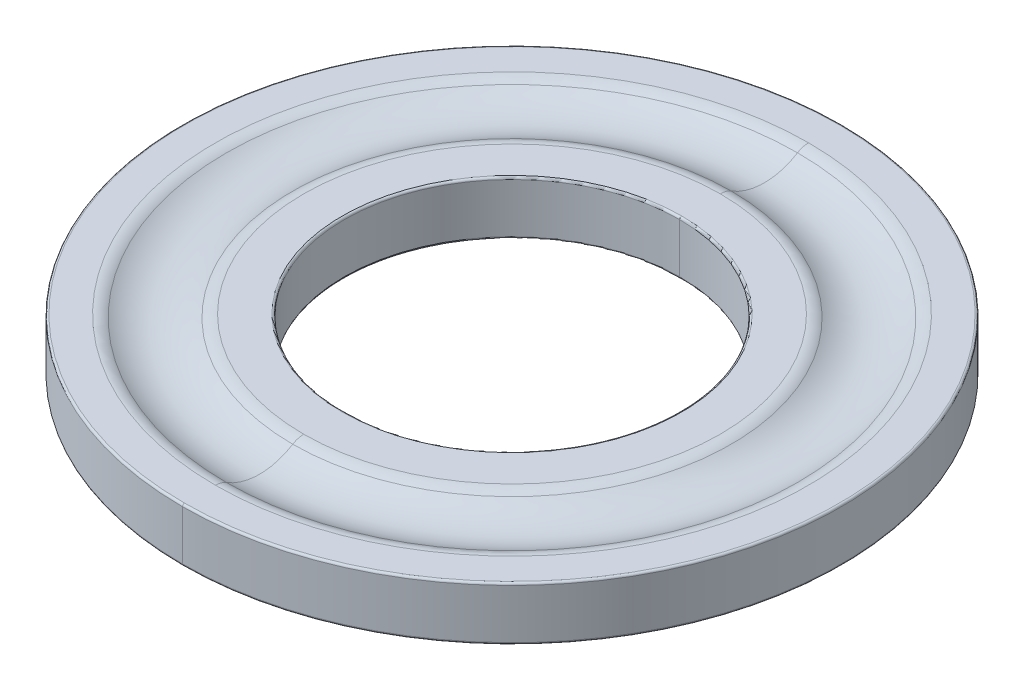
ISO-10303-21;
HEADER;
FILE_DESCRIPTION(('STEP AP214'),'2;1');
FILE_NAME('part.step','',(''),(''),'','','');
FILE_SCHEMA(('AUTOMOTIVE_DESIGN { 1 0 10303 214 1 1 1 1 }'));
ENDSEC;
DATA;
#1=APPLICATION_CONTEXT('core data for automotive mechanical design processes');
#2=APPLICATION_PROTOCOL_DEFINITION('international standard','automotive_design',2000,#1);
#3=PRODUCT_CONTEXT('',#1,'mechanical');
#4=PRODUCT('Part','Part','',(#3));
#5=PRODUCT_RELATED_PRODUCT_CATEGORY('part','',(#4));
#6=PRODUCT_DEFINITION_FORMATION('','',#4);
#7=PRODUCT_DEFINITION_CONTEXT('part definition',#1,'design');
#8=PRODUCT_DEFINITION('design','',#6,#7);
#9=PRODUCT_DEFINITION_SHAPE('','',#8);
#10=(LENGTH_UNIT() NAMED_UNIT(*) SI_UNIT(.MILLI.,.METRE.));
#11=(NAMED_UNIT(*) PLANE_ANGLE_UNIT() SI_UNIT($,.RADIAN.));
#12=(NAMED_UNIT(*) SI_UNIT($,.STERADIAN.) SOLID_ANGLE_UNIT());
#13=UNCERTAINTY_MEASURE_WITH_UNIT(LENGTH_MEASURE(1.E-05),#10,'distance_accuracy_value','');
#14=(GEOMETRIC_REPRESENTATION_CONTEXT(3) GLOBAL_UNCERTAINTY_ASSIGNED_CONTEXT((#13)) GLOBAL_UNIT_ASSIGNED_CONTEXT((#10,
#11,#12)) REPRESENTATION_CONTEXT('',''));
#15=CARTESIAN_POINT('',(0.,0.,0.));
#16=DIRECTION('',(0.,0.,1.));
#17=DIRECTION('',(1.,0.,0.));
#18=AXIS2_PLACEMENT_3D('',#15,#16,#17);
#19=CARTESIAN_POINT('',(0.,1.23,0.));
#20=DIRECTION('',(0.,1.,0.));
#21=DIRECTION('',(0.,0.,1.));
#22=AXIS2_PLACEMENT_3D('',#19,#20,#21);
#23=TOROIDAL_SURFACE('',#22,7.81,0.05);
#24=CARTESIAN_POINT('',(0.,1.23,-7.81));
#25=DIRECTION('',(1.,0.,0.));
#26=DIRECTION('',(0.,0.,-1.));
#27=AXIS2_PLACEMENT_3D('',#24,#25,#26);
#28=CIRCLE('',#27,0.05);
#29=CARTESIAN_POINT('',(0.,1.23,-7.86));
#30=VERTEX_POINT('',#29);
#31=CARTESIAN_POINT('',(0.,1.28,-7.81));
#32=VERTEX_POINT('',#31);
#33=EDGE_CURVE('E164',#30,#32,#28,.T.);
#34=ORIENTED_EDGE('',*,*,#33,.F.);
#35=CARTESIAN_POINT('',(0.,1.23,0.));
#36=DIRECTION('',(0.,-1.,0.));
#37=DIRECTION('',(0.,0.,1.));
#38=AXIS2_PLACEMENT_3D('',#35,#36,#37);
#39=CIRCLE('',#38,7.86);
#40=CARTESIAN_POINT('',(0.,1.23,7.86));
#41=VERTEX_POINT('',#40);
#42=EDGE_CURVE('E25',#41,#30,#39,.T.);
#43=ORIENTED_EDGE('',*,*,#42,.F.);
#44=CARTESIAN_POINT('',(0.,1.23,7.81));
#45=DIRECTION('',(-1.,0.,0.));
#46=DIRECTION('',(0.,0.,1.));
#47=AXIS2_PLACEMENT_3D('',#44,#45,#46);
#48=CIRCLE('',#47,0.05);
#49=CARTESIAN_POINT('',(0.,1.28,7.81));
#50=VERTEX_POINT('',#49);
#51=EDGE_CURVE('E172',#41,#50,#48,.T.);
#52=ORIENTED_EDGE('',*,*,#51,.T.);
#53=CARTESIAN_POINT('',(0.,1.28,0.));
#54=DIRECTION('',(0.,1.,0.));
#55=DIRECTION('',(0.,0.,1.));
#56=AXIS2_PLACEMENT_3D('',#53,#54,#55);
#57=CIRCLE('',#56,7.81);
#58=EDGE_CURVE('E161',#32,#50,#57,.T.);
#59=ORIENTED_EDGE('',*,*,#58,.F.);
#60=EDGE_LOOP('',(#34,#43,#52,#59));
#61=FACE_BOUND('',#60,.T.);
#62=ADVANCED_FACE('F17',(#61),#23,.T.);
#63=CARTESIAN_POINT('',(0.,0.05,0.));
#64=DIRECTION('',(0.,1.,0.));
#65=DIRECTION('',(0.,0.,1.));
#66=AXIS2_PLACEMENT_3D('',#63,#64,#65);
#67=TOROIDAL_SURFACE('',#66,7.81,0.05);
#68=CARTESIAN_POINT('',(0.,0.05,-7.81));
#69=DIRECTION('',(1.,0.,0.));
#70=DIRECTION('',(0.,0.,-1.));
#71=AXIS2_PLACEMENT_3D('',#68,#69,#70);
#72=CIRCLE('',#71,0.05);
#73=CARTESIAN_POINT('',(0.,0.,-7.81));
#74=VERTEX_POINT('',#73);
#75=CARTESIAN_POINT('',(0.,0.05,-7.86));
#76=VERTEX_POINT('',#75);
#77=EDGE_CURVE('E194',#74,#76,#72,.T.);
#78=ORIENTED_EDGE('',*,*,#77,.F.);
#79=CARTESIAN_POINT('',(0.,0.,0.));
#80=DIRECTION('',(0.,-1.,0.));
#81=DIRECTION('',(0.,0.,1.));
#82=AXIS2_PLACEMENT_3D('',#79,#80,#81);
#83=CIRCLE('',#82,7.81);
#84=CARTESIAN_POINT('',(0.,0.,7.81));
#85=VERTEX_POINT('',#84);
#86=EDGE_CURVE('E291',#85,#74,#83,.T.);
#87=ORIENTED_EDGE('',*,*,#86,.F.);
#88=CARTESIAN_POINT('',(0.,0.05,7.81));
#89=DIRECTION('',(-1.,0.,0.));
#90=DIRECTION('',(0.,0.,1.));
#91=AXIS2_PLACEMENT_3D('',#88,#89,#90);
#92=CIRCLE('',#91,0.05);
#93=CARTESIAN_POINT('',(0.,0.05,7.86));
#94=VERTEX_POINT('',#93);
#95=EDGE_CURVE('E179',#85,#94,#92,.T.);
#96=ORIENTED_EDGE('',*,*,#95,.T.);
#97=CARTESIAN_POINT('',(0.,0.05,0.));
#98=DIRECTION('',(0.,1.,0.));
#99=DIRECTION('',(0.,0.,1.));
#100=AXIS2_PLACEMENT_3D('',#97,#98,#99);
#101=CIRCLE('',#100,7.86);
#102=EDGE_CURVE('E11',#76,#94,#101,.T.);
#103=ORIENTED_EDGE('',*,*,#102,.F.);
#104=EDGE_LOOP('',(#78,#87,#96,#103));
#105=FACE_BOUND('',#104,.T.);
#106=ADVANCED_FACE('F640',(#105),#67,.T.);
#107=CARTESIAN_POINT('',(0.,1.23,0.));
#108=DIRECTION('',(0.,1.,0.));
#109=DIRECTION('',(0.,0.,1.));
#110=AXIS2_PLACEMENT_3D('',#107,#108,#109);
#111=TOROIDAL_SURFACE('',#110,4.05,0.05);
#112=CARTESIAN_POINT('',(0.,1.23,-4.05));
#113=DIRECTION('',(1.,0.,0.));
#114=DIRECTION('',(0.,0.,-1.));
#115=AXIS2_PLACEMENT_3D('',#112,#113,#114);
#116=CIRCLE('',#115,0.05);
#117=CARTESIAN_POINT('',(0.,1.28,-4.05));
#118=VERTEX_POINT('',#117);
#119=CARTESIAN_POINT('',(0.,1.23,-4.));
#120=VERTEX_POINT('',#119);
#121=EDGE_CURVE('E217',#118,#120,#116,.T.);
#122=ORIENTED_EDGE('',*,*,#121,.F.);
#123=CARTESIAN_POINT('',(0.,1.28,0.));
#124=DIRECTION('',(0.,-1.,0.));
#125=DIRECTION('',(0.,0.,1.));
#126=AXIS2_PLACEMENT_3D('',#123,#124,#125);
#127=CIRCLE('',#126,4.05);
#128=CARTESIAN_POINT('',(0.,1.28,4.05));
#129=VERTEX_POINT('',#128);
#130=EDGE_CURVE('E288',#129,#118,#127,.T.);
#131=ORIENTED_EDGE('',*,*,#130,.F.);
#132=CARTESIAN_POINT('',(0.,1.23,4.05));
#133=DIRECTION('',(-1.,0.,0.));
#134=DIRECTION('',(0.,0.,1.));
#135=AXIS2_PLACEMENT_3D('',#132,#133,#134);
#136=CIRCLE('',#135,0.05);
#137=CARTESIAN_POINT('',(0.,1.23,4.));
#138=VERTEX_POINT('',#137);
#139=EDGE_CURVE('E216',#129,#138,#136,.T.);
#140=ORIENTED_EDGE('',*,*,#139,.T.);
#141=CARTESIAN_POINT('',(0.,1.23,0.));
#142=DIRECTION('',(0.,1.,0.));
#143=DIRECTION('',(0.,0.,1.));
#144=AXIS2_PLACEMENT_3D('',#141,#142,#143);
#145=CIRCLE('',#144,4.);
#146=EDGE_CURVE('E264',#120,#138,#145,.T.);
#147=ORIENTED_EDGE('',*,*,#146,.F.);
#148=EDGE_LOOP('',(#122,#131,#140,#147));
#149=FACE_BOUND('',#148,.T.);
#150=ADVANCED_FACE('F630',(#149),#111,.T.);
#151=CARTESIAN_POINT('',(0.,0.05,0.));
#152=DIRECTION('',(0.,1.,0.));
#153=DIRECTION('',(0.,0.,1.));
#154=AXIS2_PLACEMENT_3D('',#151,#152,#153);
#155=TOROIDAL_SURFACE('',#154,4.05,0.05);
#156=CARTESIAN_POINT('',(0.,0.05,-4.05));
#157=DIRECTION('',(1.,0.,0.));
#158=DIRECTION('',(0.,0.,-1.));
#159=AXIS2_PLACEMENT_3D('',#156,#157,#158);
#160=CIRCLE('',#159,0.05);
#161=CARTESIAN_POINT('',(0.,0.05,-4.));
#162=VERTEX_POINT('',#161);
#163=CARTESIAN_POINT('',(0.,0.,-4.05));
#164=VERTEX_POINT('',#163);
#165=EDGE_CURVE('E202',#162,#164,#160,.T.);
#166=ORIENTED_EDGE('',*,*,#165,.F.);
#167=CARTESIAN_POINT('',(0.,0.05,0.));
#168=DIRECTION('',(0.,-1.,0.));
#169=DIRECTION('',(0.,0.,1.));
#170=AXIS2_PLACEMENT_3D('',#167,#168,#169);
#171=CIRCLE('',#170,4.);
#172=CARTESIAN_POINT('',(0.,0.05,4.));
#173=VERTEX_POINT('',#172);
#174=EDGE_CURVE('E189',#173,#162,#171,.T.);
#175=ORIENTED_EDGE('',*,*,#174,.F.);
#176=CARTESIAN_POINT('',(0.,0.05,4.05));
#177=DIRECTION('',(-1.,0.,0.));
#178=DIRECTION('',(0.,0.,1.));
#179=AXIS2_PLACEMENT_3D('',#176,#177,#178);
#180=CIRCLE('',#179,0.05);
#181=CARTESIAN_POINT('',(0.,0.,4.05));
#182=VERTEX_POINT('',#181);
#183=EDGE_CURVE('E201',#173,#182,#180,.T.);
#184=ORIENTED_EDGE('',*,*,#183,.T.);
#185=CARTESIAN_POINT('',(0.,0.,0.));
#186=DIRECTION('',(0.,1.,0.));
#187=DIRECTION('',(0.,0.,1.));
#188=AXIS2_PLACEMENT_3D('',#185,#186,#187);
#189=CIRCLE('',#188,4.05);
#190=EDGE_CURVE('E151',#164,#182,#189,.T.);
#191=ORIENTED_EDGE('',*,*,#190,.F.);
#192=EDGE_LOOP('',(#166,#175,#184,#191));
#193=FACE_BOUND('',#192,.T.);
#194=ADVANCED_FACE('F303',(#193),#155,.T.);
#195=CARTESIAN_POINT('',(0.,0.78,0.));
#196=DIRECTION('',(0.,1.,0.));
#197=DIRECTION('',(0.,0.,1.));
#198=AXIS2_PLACEMENT_3D('',#195,#196,#197);
#199=TOROIDAL_SURFACE('',#198,7.07356537528527,0.5);
#200=CARTESIAN_POINT('',(0.,0.78,-7.07356537528527));
#201=DIRECTION('',(1.,0.,0.));
#202=DIRECTION('',(0.,0.,-1.));
#203=AXIS2_PLACEMENT_3D('',#200,#201,#202);
#204=CIRCLE('',#203,0.5);
#205=CARTESIAN_POINT('',(0.,1.28,-7.07356537528527));
#206=VERTEX_POINT('',#205);
#207=CARTESIAN_POINT('',(0.,1.205,-6.81017403146395));
#208=VERTEX_POINT('',#207);
#209=EDGE_CURVE('E221',#206,#208,#204,.T.);
#210=ORIENTED_EDGE('',*,*,#209,.F.);
#211=CARTESIAN_POINT('',(0.,1.28,0.));
#212=DIRECTION('',(0.,-1.,0.));
#213=DIRECTION('',(0.,0.,1.));
#214=AXIS2_PLACEMENT_3D('',#211,#212,#213);
#215=CIRCLE('',#214,7.07356537528527);
#216=CARTESIAN_POINT('',(0.,1.28,7.07356537528527));
#217=VERTEX_POINT('',#216);
#218=EDGE_CURVE('E205',#217,#206,#215,.T.);
#219=ORIENTED_EDGE('',*,*,#218,.F.);
#220=CARTESIAN_POINT('',(0.,0.78,7.07356537528527));
#221=DIRECTION('',(-1.,0.,0.));
#222=DIRECTION('',(0.,0.,1.));
#223=AXIS2_PLACEMENT_3D('',#220,#221,#222);
#224=CIRCLE('',#223,0.5);
#225=CARTESIAN_POINT('',(0.,1.205,6.81017403146395));
#226=VERTEX_POINT('',#225);
#227=EDGE_CURVE('E251',#217,#226,#224,.T.);
#228=ORIENTED_EDGE('',*,*,#227,.T.);
#229=CARTESIAN_POINT('',(0.,1.205,0.));
#230=DIRECTION('',(0.,1.,0.));
#231=DIRECTION('',(0.,0.,1.));
#232=AXIS2_PLACEMENT_3D('',#229,#230,#231);
#233=CIRCLE('',#232,6.81017403146395);
#234=EDGE_CURVE('E183',#208,#226,#233,.T.);
#235=ORIENTED_EDGE('',*,*,#234,.F.);
#236=EDGE_LOOP('',(#210,#219,#228,#235));
#237=FACE_BOUND('',#236,.T.);
#238=ADVANCED_FACE('F610',(#237),#199,.T.);
#239=CARTESIAN_POINT('',(0.,0.78,0.));
#240=DIRECTION('',(0.,-1.,0.));
#241=DIRECTION('',(0.,0.,-1.));
#242=AXIS2_PLACEMENT_3D('',#239,#240,#241);
#243=TOROIDAL_SURFACE('',#242,4.96643462471473,0.5);
#244=CARTESIAN_POINT('',(0.,0.78,4.96643462471473));
#245=DIRECTION('',(1.,0.,0.));
#246=DIRECTION('',(0.,0.,-1.));
#247=AXIS2_PLACEMENT_3D('',#244,#245,#246);
#248=CIRCLE('',#247,0.5);
#249=CARTESIAN_POINT('',(0.,1.28,4.96643462471473));
#250=VERTEX_POINT('',#249);
#251=CARTESIAN_POINT('',(0.,1.205,5.22982596853605));
#252=VERTEX_POINT('',#251);
#253=EDGE_CURVE('E228',#250,#252,#248,.T.);
#254=ORIENTED_EDGE('',*,*,#253,.F.);
#255=CARTESIAN_POINT('',(0.,1.28,0.));
#256=DIRECTION('',(0.,1.,0.));
#257=DIRECTION('',(0.,0.,1.));
#258=AXIS2_PLACEMENT_3D('',#255,#256,#257);
#259=CIRCLE('',#258,4.96643462471473);
#260=CARTESIAN_POINT('',(0.,1.28,-4.96643462471473));
#261=VERTEX_POINT('',#260);
#262=EDGE_CURVE('E285',#261,#250,#259,.T.);
#263=ORIENTED_EDGE('',*,*,#262,.F.);
#264=CARTESIAN_POINT('',(0.,0.78,-4.96643462471473));
#265=DIRECTION('',(-1.,0.,0.));
#266=DIRECTION('',(0.,0.,1.));
#267=AXIS2_PLACEMENT_3D('',#264,#265,#266);
#268=CIRCLE('',#267,0.5);
#269=CARTESIAN_POINT('',(0.,1.205,-5.22982596853605));
#270=VERTEX_POINT('',#269);
#271=EDGE_CURVE('E181',#261,#270,#268,.T.);
#272=ORIENTED_EDGE('',*,*,#271,.T.);
#273=CARTESIAN_POINT('',(0.,1.205,0.));
#274=DIRECTION('',(0.,-1.,0.));
#275=DIRECTION('',(0.,0.,1.));
#276=AXIS2_PLACEMENT_3D('',#273,#274,#275);
#277=CIRCLE('',#276,5.22982596853605);
#278=EDGE_CURVE('E48',#252,#270,#277,.T.);
#279=ORIENTED_EDGE('',*,*,#278,.F.);
#280=EDGE_LOOP('',(#254,#263,#272,#279));
#281=FACE_BOUND('',#280,.T.);
#282=ADVANCED_FACE('F520',(#281),#243,.T.);
#283=CARTESIAN_POINT('',(0.,2.48,0.));
#284=DIRECTION('',(0.,-1.,0.));
#285=DIRECTION('',(0.,0.,-1.));
#286=AXIS2_PLACEMENT_3D('',#283,#284,#285);
#287=TOROIDAL_SURFACE('',#286,6.02,1.5);
#288=CARTESIAN_POINT('',(0.,2.48,6.02));
#289=DIRECTION('',(1.,0.,0.));
#290=DIRECTION('',(0.,0.,-1.));
#291=AXIS2_PLACEMENT_3D('',#288,#289,#290);
#292=CIRCLE('',#291,1.5);
#293=EDGE_CURVE('E263',#226,#252,#292,.T.);
#294=ORIENTED_EDGE('',*,*,#293,.F.);
#295=CARTESIAN_POINT('',(0.,1.205,0.));
#296=DIRECTION('',(0.,1.,0.));
#297=DIRECTION('',(0.,0.,1.));
#298=AXIS2_PLACEMENT_3D('',#295,#296,#297);
#299=CIRCLE('',#298,6.81017403146395);
#300=EDGE_CURVE('E248',#226,#208,#299,.T.);
#301=ORIENTED_EDGE('',*,*,#300,.T.);
#302=CARTESIAN_POINT('',(0.,2.48,-6.02));
#303=DIRECTION('',(-1.,0.,0.));
#304=DIRECTION('',(0.,0.,1.));
#305=AXIS2_PLACEMENT_3D('',#302,#303,#304);
#306=CIRCLE('',#305,1.5);
#307=EDGE_CURVE('E38',#208,#270,#306,.T.);
#308=ORIENTED_EDGE('',*,*,#307,.T.);
#309=CARTESIAN_POINT('',(0.,1.205,0.));
#310=DIRECTION('',(0.,-1.,0.));
#311=DIRECTION('',(0.,0.,1.));
#312=AXIS2_PLACEMENT_3D('',#309,#310,#311);
#313=CIRCLE('',#312,5.22982596853605);
#314=EDGE_CURVE('E184',#270,#252,#313,.T.);
#315=ORIENTED_EDGE('',*,*,#314,.T.);
#316=EDGE_LOOP('',(#294,#301,#308,#315));
#317=FACE_BOUND('',#316,.T.);
#318=ADVANCED_FACE('F515',(#317),#287,.F.);
#319=CARTESIAN_POINT('',(0.,1.28,0.));
#320=DIRECTION('',(0.,-1.,0.));
#321=DIRECTION('',(0.,0.,-1.));
#322=AXIS2_PLACEMENT_3D('',#319,#320,#321);
#323=CYLINDRICAL_SURFACE('',#322,4.);
#324=DIRECTION('',(0.,-1.,0.));
#325=VECTOR('',#324,1.);
#326=CARTESIAN_POINT('',(0.,1.28,4.));
#327=LINE('',#326,#325);
#328=EDGE_CURVE('E268',#138,#173,#327,.T.);
#329=ORIENTED_EDGE('',*,*,#328,.F.);
#330=CARTESIAN_POINT('',(0.,1.23,0.));
#331=DIRECTION('',(0.,1.,0.));
#332=DIRECTION('',(0.,0.,1.));
#333=AXIS2_PLACEMENT_3D('',#330,#331,#332);
#334=CIRCLE('',#333,4.);
#335=EDGE_CURVE('E212',#138,#120,#334,.T.);
#336=ORIENTED_EDGE('',*,*,#335,.T.);
#337=DIRECTION('',(0.,-1.,0.));
#338=VECTOR('',#337,1.);
#339=CARTESIAN_POINT('',(0.,1.28,-4.));
#340=LINE('',#339,#338);
#341=EDGE_CURVE('E186',#120,#162,#340,.T.);
#342=ORIENTED_EDGE('',*,*,#341,.T.);
#343=CARTESIAN_POINT('',(0.,0.05,0.));
#344=DIRECTION('',(0.,-1.,0.));
#345=DIRECTION('',(0.,0.,1.));
#346=AXIS2_PLACEMENT_3D('',#343,#344,#345);
#347=CIRCLE('',#346,4.);
#348=EDGE_CURVE('E241',#162,#173,#347,.T.);
#349=ORIENTED_EDGE('',*,*,#348,.T.);
#350=EDGE_LOOP('',(#329,#336,#342,#349));
#351=FACE_BOUND('',#350,.T.);
#352=ADVANCED_FACE('F519',(#351),#323,.F.);
#353=CARTESIAN_POINT('',(0.,1.28,0.));
#354=DIRECTION('',(0.,-1.,0.));
#355=DIRECTION('',(0.,0.,-1.));
#356=AXIS2_PLACEMENT_3D('',#353,#354,#355);
#357=CYLINDRICAL_SURFACE('',#356,7.86);
#358=DIRECTION('',(0.,-1.,0.));
#359=VECTOR('',#358,1.);
#360=CARTESIAN_POINT('',(0.,1.28,7.86));
#361=LINE('',#360,#359);
#362=EDGE_CURVE('E145',#41,#94,#361,.T.);
#363=ORIENTED_EDGE('',*,*,#362,.F.);
#364=ORIENTED_EDGE('',*,*,#42,.T.);
#365=DIRECTION('',(0.,-1.,0.));
#366=VECTOR('',#365,1.);
#367=CARTESIAN_POINT('',(0.,1.28,-7.86));
#368=LINE('',#367,#366);
#369=EDGE_CURVE('E142',#30,#76,#368,.T.);
#370=ORIENTED_EDGE('',*,*,#369,.T.);
#371=ORIENTED_EDGE('',*,*,#102,.T.);
#372=EDGE_LOOP('',(#363,#364,#370,#371));
#373=FACE_BOUND('',#372,.T.);
#374=ADVANCED_FACE('F141',(#373),#357,.T.);
#375=CARTESIAN_POINT('',(0.,0.,0.));
#376=DIRECTION('',(0.,1.,0.));
#377=DIRECTION('',(1.,0.,0.));
#378=AXIS2_PLACEMENT_3D('',#375,#376,#377);
#379=PLANE('',#378);
#380=CARTESIAN_POINT('',(0.,0.,0.));
#381=DIRECTION('',(0.,1.,0.));
#382=DIRECTION('',(0.,0.,1.));
#383=AXIS2_PLACEMENT_3D('',#380,#381,#382);
#384=CIRCLE('',#383,4.05);
#385=EDGE_CURVE('E197',#182,#164,#384,.T.);
#386=ORIENTED_EDGE('',*,*,#385,.T.);
#387=ORIENTED_EDGE('',*,*,#190,.T.);
#388=EDGE_LOOP('',(#386,#387));
#389=FACE_BOUND('',#388,.T.);
#390=ORIENTED_EDGE('',*,*,#86,.T.);
#391=CARTESIAN_POINT('',(0.,0.,0.));
#392=DIRECTION('',(0.,-1.,0.));
#393=DIRECTION('',(0.,0.,1.));
#394=AXIS2_PLACEMENT_3D('',#391,#392,#393);
#395=CIRCLE('',#394,7.81);
#396=EDGE_CURVE('E190',#74,#85,#395,.T.);
#397=ORIENTED_EDGE('',*,*,#396,.T.);
#398=EDGE_LOOP('',(#390,#397));
#399=FACE_BOUND('',#398,.T.);
#400=ADVANCED_FACE('F297',(#389,#399),#379,.F.);
#401=CARTESIAN_POINT('',(0.,1.28,0.));
#402=DIRECTION('',(0.,1.,0.));
#403=DIRECTION('',(1.,0.,0.));
#404=AXIS2_PLACEMENT_3D('',#401,#402,#403);
#405=PLANE('',#404);
#406=ORIENTED_EDGE('',*,*,#130,.T.);
#407=CARTESIAN_POINT('',(0.,1.28,0.));
#408=DIRECTION('',(0.,-1.,0.));
#409=DIRECTION('',(0.,0.,1.));
#410=AXIS2_PLACEMENT_3D('',#407,#408,#409);
#411=CIRCLE('',#410,4.05);
#412=EDGE_CURVE('E224',#118,#129,#411,.T.);
#413=ORIENTED_EDGE('',*,*,#412,.T.);
#414=EDGE_LOOP('',(#406,#413));
#415=FACE_BOUND('',#414,.T.);
#416=ORIENTED_EDGE('',*,*,#262,.T.);
#417=CARTESIAN_POINT('',(0.,1.28,0.));
#418=DIRECTION('',(0.,1.,0.));
#419=DIRECTION('',(0.,0.,1.));
#420=AXIS2_PLACEMENT_3D('',#417,#418,#419);
#421=CIRCLE('',#420,4.96643462471473);
#422=EDGE_CURVE('E232',#250,#261,#421,.T.);
#423=ORIENTED_EDGE('',*,*,#422,.T.);
#424=EDGE_LOOP('',(#416,#423));
#425=FACE_BOUND('',#424,.T.);
#426=ADVANCED_FACE('F468',(#415,#425),#405,.T.);
#427=CARTESIAN_POINT('',(0.,1.28,0.));
#428=DIRECTION('',(0.,1.,0.));
#429=DIRECTION('',(1.,0.,0.));
#430=AXIS2_PLACEMENT_3D('',#427,#428,#429);
#431=PLANE('',#430);
#432=ORIENTED_EDGE('',*,*,#218,.T.);
#433=CARTESIAN_POINT('',(0.,1.28,0.));
#434=DIRECTION('',(0.,-1.,0.));
#435=DIRECTION('',(0.,0.,1.));
#436=AXIS2_PLACEMENT_3D('',#433,#434,#435);
#437=CIRCLE('',#436,7.07356537528527);
#438=EDGE_CURVE('E211',#206,#217,#437,.T.);
#439=ORIENTED_EDGE('',*,*,#438,.T.);
#440=EDGE_LOOP('',(#432,#439));
#441=FACE_BOUND('',#440,.T.);
#442=CARTESIAN_POINT('',(0.,1.28,0.));
#443=DIRECTION('',(0.,1.,0.));
#444=DIRECTION('',(0.,0.,1.));
#445=AXIS2_PLACEMENT_3D('',#442,#443,#444);
#446=CIRCLE('',#445,7.81);
#447=EDGE_CURVE('E169',#50,#32,#446,.T.);
#448=ORIENTED_EDGE('',*,*,#447,.T.);
#449=ORIENTED_EDGE('',*,*,#58,.T.);
#450=EDGE_LOOP('',(#448,#449));
#451=FACE_BOUND('',#450,.T.);
#452=ADVANCED_FACE('F487',(#441,#451),#431,.T.);
#453=CARTESIAN_POINT('',(0.,1.28,0.));
#454=DIRECTION('',(0.,-1.,0.));
#455=DIRECTION('',(0.,0.,-1.));
#456=AXIS2_PLACEMENT_3D('',#453,#454,#455);
#457=CYLINDRICAL_SURFACE('',#456,7.86);
#458=CARTESIAN_POINT('',(0.,1.23,0.));
#459=DIRECTION('',(0.,-1.,0.));
#460=DIRECTION('',(0.,0.,1.));
#461=AXIS2_PLACEMENT_3D('',#458,#459,#460);
#462=CIRCLE('',#461,7.86);
#463=EDGE_CURVE('E156',#30,#41,#462,.T.);
#464=ORIENTED_EDGE('',*,*,#463,.T.);
#465=ORIENTED_EDGE('',*,*,#362,.T.);
#466=CARTESIAN_POINT('',(0.,0.05,0.));
#467=DIRECTION('',(0.,1.,0.));
#468=DIRECTION('',(0.,0.,1.));
#469=AXIS2_PLACEMENT_3D('',#466,#467,#468);
#470=CIRCLE('',#469,7.86);
#471=EDGE_CURVE('E158',#94,#76,#470,.T.);
#472=ORIENTED_EDGE('',*,*,#471,.T.);
#473=ORIENTED_EDGE('',*,*,#369,.F.);
#474=EDGE_LOOP('',(#464,#465,#472,#473));
#475=FACE_BOUND('',#474,.T.);
#476=ADVANCED_FACE('F154',(#475),#457,.T.);
#477=CARTESIAN_POINT('',(0.,1.28,0.));
#478=DIRECTION('',(0.,-1.,0.));
#479=DIRECTION('',(0.,0.,-1.));
#480=AXIS2_PLACEMENT_3D('',#477,#478,#479);
#481=CYLINDRICAL_SURFACE('',#480,4.);
#482=ORIENTED_EDGE('',*,*,#146,.T.);
#483=ORIENTED_EDGE('',*,*,#328,.T.);
#484=ORIENTED_EDGE('',*,*,#174,.T.);
#485=ORIENTED_EDGE('',*,*,#341,.F.);
#486=EDGE_LOOP('',(#482,#483,#484,#485));
#487=FACE_BOUND('',#486,.T.);
#488=ADVANCED_FACE('F547',(#487),#481,.F.);
#489=CARTESIAN_POINT('',(0.,2.48,0.));
#490=DIRECTION('',(0.,-1.,0.));
#491=DIRECTION('',(0.,0.,-1.));
#492=AXIS2_PLACEMENT_3D('',#489,#490,#491);
#493=TOROIDAL_SURFACE('',#492,6.02,1.5);
#494=ORIENTED_EDGE('',*,*,#234,.T.);
#495=ORIENTED_EDGE('',*,*,#293,.T.);
#496=ORIENTED_EDGE('',*,*,#278,.T.);
#497=ORIENTED_EDGE('',*,*,#307,.F.);
#498=EDGE_LOOP('',(#494,#495,#496,#497));
#499=FACE_BOUND('',#498,.T.);
#500=ADVANCED_FACE('F551',(#499),#493,.F.);
#501=CARTESIAN_POINT('',(0.,0.78,0.));
#502=DIRECTION('',(0.,-1.,0.));
#503=DIRECTION('',(0.,0.,-1.));
#504=AXIS2_PLACEMENT_3D('',#501,#502,#503);
#505=TOROIDAL_SURFACE('',#504,4.96643462471473,0.5);
#506=ORIENTED_EDGE('',*,*,#422,.F.);
#507=ORIENTED_EDGE('',*,*,#253,.T.);
#508=ORIENTED_EDGE('',*,*,#314,.F.);
#509=ORIENTED_EDGE('',*,*,#271,.F.);
#510=EDGE_LOOP('',(#506,#507,#508,#509));
#511=FACE_BOUND('',#510,.T.);
#512=ADVANCED_FACE('F539',(#511),#505,.T.);
#513=CARTESIAN_POINT('',(0.,0.78,0.));
#514=DIRECTION('',(0.,1.,0.));
#515=DIRECTION('',(0.,0.,1.));
#516=AXIS2_PLACEMENT_3D('',#513,#514,#515);
#517=TOROIDAL_SURFACE('',#516,7.07356537528527,0.5);
#518=ORIENTED_EDGE('',*,*,#438,.F.);
#519=ORIENTED_EDGE('',*,*,#209,.T.);
#520=ORIENTED_EDGE('',*,*,#300,.F.);
#521=ORIENTED_EDGE('',*,*,#227,.F.);
#522=EDGE_LOOP('',(#518,#519,#520,#521));
#523=FACE_BOUND('',#522,.T.);
#524=ADVANCED_FACE('F498',(#523),#517,.T.);
#525=CARTESIAN_POINT('',(0.,0.05,0.));
#526=DIRECTION('',(0.,1.,0.));
#527=DIRECTION('',(0.,0.,1.));
#528=AXIS2_PLACEMENT_3D('',#525,#526,#527);
#529=TOROIDAL_SURFACE('',#528,4.05,0.05);
#530=ORIENTED_EDGE('',*,*,#348,.F.);
#531=ORIENTED_EDGE('',*,*,#165,.T.);
#532=ORIENTED_EDGE('',*,*,#385,.F.);
#533=ORIENTED_EDGE('',*,*,#183,.F.);
#534=EDGE_LOOP('',(#530,#531,#532,#533));
#535=FACE_BOUND('',#534,.T.);
#536=ADVANCED_FACE('F307',(#535),#529,.T.);
#537=CARTESIAN_POINT('',(0.,1.23,0.));
#538=DIRECTION('',(0.,1.,0.));
#539=DIRECTION('',(0.,0.,1.));
#540=AXIS2_PLACEMENT_3D('',#537,#538,#539);
#541=TOROIDAL_SURFACE('',#540,4.05,0.05);
#542=ORIENTED_EDGE('',*,*,#412,.F.);
#543=ORIENTED_EDGE('',*,*,#121,.T.);
#544=ORIENTED_EDGE('',*,*,#335,.F.);
#545=ORIENTED_EDGE('',*,*,#139,.F.);
#546=EDGE_LOOP('',(#542,#543,#544,#545));
#547=FACE_BOUND('',#546,.T.);
#548=ADVANCED_FACE('F456',(#547),#541,.T.);
#549=CARTESIAN_POINT('',(0.,0.05,0.));
#550=DIRECTION('',(0.,1.,0.));
#551=DIRECTION('',(0.,0.,1.));
#552=AXIS2_PLACEMENT_3D('',#549,#550,#551);
#553=TOROIDAL_SURFACE('',#552,7.81,0.05);
#554=ORIENTED_EDGE('',*,*,#396,.F.);
#555=ORIENTED_EDGE('',*,*,#77,.T.);
#556=ORIENTED_EDGE('',*,*,#471,.F.);
#557=ORIENTED_EDGE('',*,*,#95,.F.);
#558=EDGE_LOOP('',(#554,#555,#556,#557));
#559=FACE_BOUND('',#558,.T.);
#560=ADVANCED_FACE('F451',(#559),#553,.T.);
#561=CARTESIAN_POINT('',(0.,1.23,0.));
#562=DIRECTION('',(0.,1.,0.));
#563=DIRECTION('',(0.,0.,1.));
#564=AXIS2_PLACEMENT_3D('',#561,#562,#563);
#565=TOROIDAL_SURFACE('',#564,7.81,0.05);
#566=ORIENTED_EDGE('',*,*,#463,.F.);
#567=ORIENTED_EDGE('',*,*,#33,.T.);
#568=ORIENTED_EDGE('',*,*,#447,.F.);
#569=ORIENTED_EDGE('',*,*,#51,.F.);
#570=EDGE_LOOP('',(#566,#567,#568,#569));
#571=FACE_BOUND('',#570,.T.);
#572=ADVANCED_FACE('F171',(#571),#565,.T.);
#573=CLOSED_SHELL('',(#62,#106,#150,#194,#238,#282,#318,#352,#374,#400,#426,#452,#476,#488,#500,
#512,#524,#536,#548,#560,#572));
#574=MANIFOLD_SOLID_BREP('B1',#573);
#575=ADVANCED_BREP_SHAPE_REPRESENTATION('',(#18,#574),#14);
#576=SHAPE_DEFINITION_REPRESENTATION(#9,#575);
ENDSEC;
END-ISO-10303-21;
